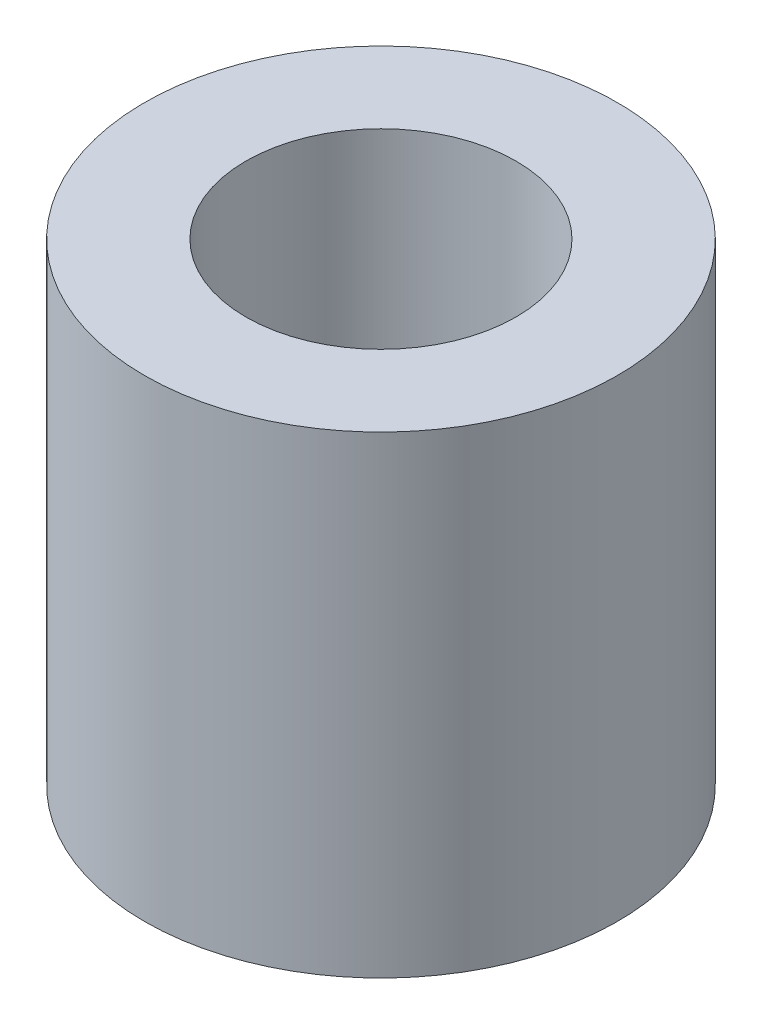
ISO-10303-21;
HEADER;
FILE_DESCRIPTION(('STEP AP214'),'2;1');
FILE_NAME('part.step','',(''),(''),'','','');
FILE_SCHEMA(('AUTOMOTIVE_DESIGN { 1 0 10303 214 1 1 1 1 }'));
ENDSEC;
DATA;
#1=APPLICATION_CONTEXT('core data for automotive mechanical design processes');
#2=APPLICATION_PROTOCOL_DEFINITION('international standard','automotive_design',2000,#1);
#3=PRODUCT_CONTEXT('',#1,'mechanical');
#4=PRODUCT('Part','Part','',(#3));
#5=PRODUCT_RELATED_PRODUCT_CATEGORY('part','',(#4));
#6=PRODUCT_DEFINITION_FORMATION('','',#4);
#7=PRODUCT_DEFINITION_CONTEXT('part definition',#1,'design');
#8=PRODUCT_DEFINITION('design','',#6,#7);
#9=PRODUCT_DEFINITION_SHAPE('','',#8);
#10=(LENGTH_UNIT() NAMED_UNIT(*) SI_UNIT(.MILLI.,.METRE.));
#11=(NAMED_UNIT(*) PLANE_ANGLE_UNIT() SI_UNIT($,.RADIAN.));
#12=(NAMED_UNIT(*) SI_UNIT($,.STERADIAN.) SOLID_ANGLE_UNIT());
#13=UNCERTAINTY_MEASURE_WITH_UNIT(LENGTH_MEASURE(1.E-05),#10,'distance_accuracy_value','');
#14=(GEOMETRIC_REPRESENTATION_CONTEXT(3) GLOBAL_UNCERTAINTY_ASSIGNED_CONTEXT((#13)) GLOBAL_UNIT_ASSIGNED_CONTEXT((#10,
#11,#12)) REPRESENTATION_CONTEXT('',''));
#15=CARTESIAN_POINT('',(0.,0.,0.));
#16=DIRECTION('',(0.,0.,1.));
#17=DIRECTION('',(1.,0.,0.));
#18=AXIS2_PLACEMENT_3D('',#15,#16,#17);
#19=CARTESIAN_POINT('',(0.,3.5,0.));
#20=DIRECTION('',(0.,1.,0.));
#21=DIRECTION('',(0.,0.,1.));
#22=AXIS2_PLACEMENT_3D('',#19,#20,#21);
#23=PLANE('',#22);
#24=CARTESIAN_POINT('',(0.,3.5,0.));
#25=DIRECTION('',(0.,1.,0.));
#26=DIRECTION('',(0.,0.,1.));
#27=AXIS2_PLACEMENT_3D('',#24,#25,#26);
#28=CIRCLE('',#27,3.5);
#29=CARTESIAN_POINT('',(0.,3.5,3.5));
#30=VERTEX_POINT('',#29);
#31=EDGE_CURVE('E10',#30,#30,#28,.T.);
#32=ORIENTED_EDGE('',*,*,#31,.T.);
#33=EDGE_LOOP('',(#32));
#34=FACE_BOUND('',#33,.T.);
#35=CARTESIAN_POINT('',(0.,3.5,0.));
#36=DIRECTION('',(0.,1.,0.));
#37=DIRECTION('',(0.,0.,1.));
#38=AXIS2_PLACEMENT_3D('',#35,#36,#37);
#39=CIRCLE('',#38,2.);
#40=CARTESIAN_POINT('',(0.,3.5,2.));
#41=VERTEX_POINT('',#40);
#42=EDGE_CURVE('E45',#41,#41,#39,.T.);
#43=ORIENTED_EDGE('',*,*,#42,.F.);
#44=EDGE_LOOP('',(#43));
#45=FACE_BOUND('',#44,.T.);
#46=ADVANCED_FACE('F34',(#34,#45),#23,.T.);
#47=CARTESIAN_POINT('',(0.,-3.5,0.));
#48=DIRECTION('',(0.,1.,0.));
#49=DIRECTION('',(0.,0.,1.));
#50=AXIS2_PLACEMENT_3D('',#47,#48,#49);
#51=PLANE('',#50);
#52=CARTESIAN_POINT('',(0.,-3.5,0.));
#53=DIRECTION('',(0.,1.,0.));
#54=DIRECTION('',(0.,0.,1.));
#55=AXIS2_PLACEMENT_3D('',#52,#53,#54);
#56=CIRCLE('',#55,3.5);
#57=CARTESIAN_POINT('',(0.,-3.5,3.5));
#58=VERTEX_POINT('',#57);
#59=EDGE_CURVE('E38',#58,#58,#56,.T.);
#60=ORIENTED_EDGE('',*,*,#59,.F.);
#61=EDGE_LOOP('',(#60));
#62=FACE_BOUND('',#61,.T.);
#63=CARTESIAN_POINT('',(0.,-3.5,0.));
#64=DIRECTION('',(0.,1.,0.));
#65=DIRECTION('',(0.,0.,1.));
#66=AXIS2_PLACEMENT_3D('',#63,#64,#65);
#67=CIRCLE('',#66,2.);
#68=CARTESIAN_POINT('',(0.,-3.5,2.));
#69=VERTEX_POINT('',#68);
#70=EDGE_CURVE('E47',#69,#69,#67,.T.);
#71=ORIENTED_EDGE('',*,*,#70,.T.);
#72=EDGE_LOOP('',(#71));
#73=FACE_BOUND('',#72,.T.);
#74=ADVANCED_FACE('F57',(#62,#73),#51,.F.);
#75=CARTESIAN_POINT('',(0.,3.5,0.));
#76=DIRECTION('',(0.,-1.,0.));
#77=DIRECTION('',(0.,0.,-1.));
#78=AXIS2_PLACEMENT_3D('',#75,#76,#77);
#79=CYLINDRICAL_SURFACE('',#78,3.5);
#80=ORIENTED_EDGE('',*,*,#31,.F.);
#81=EDGE_LOOP('',(#80));
#82=FACE_BOUND('',#81,.T.);
#83=ORIENTED_EDGE('',*,*,#59,.T.);
#84=EDGE_LOOP('',(#83));
#85=FACE_BOUND('',#84,.T.);
#86=ADVANCED_FACE('F36',(#82,#85),#79,.T.);
#87=CARTESIAN_POINT('',(0.,3.5,0.));
#88=DIRECTION('',(0.,-1.,0.));
#89=DIRECTION('',(0.,0.,-1.));
#90=AXIS2_PLACEMENT_3D('',#87,#88,#89);
#91=CYLINDRICAL_SURFACE('',#90,2.);
#92=ORIENTED_EDGE('',*,*,#42,.T.);
#93=EDGE_LOOP('',(#92));
#94=FACE_BOUND('',#93,.T.);
#95=ORIENTED_EDGE('',*,*,#70,.F.);
#96=EDGE_LOOP('',(#95));
#97=FACE_BOUND('',#96,.T.);
#98=ADVANCED_FACE('F53',(#94,#97),#91,.F.);
#99=CLOSED_SHELL('',(#46,#74,#86,#98));
#100=MANIFOLD_SOLID_BREP('B2',#99);
#101=ADVANCED_BREP_SHAPE_REPRESENTATION('',(#18,#100),#14);
#102=SHAPE_DEFINITION_REPRESENTATION(#9,#101);
ENDSEC;
END-ISO-10303-21;
